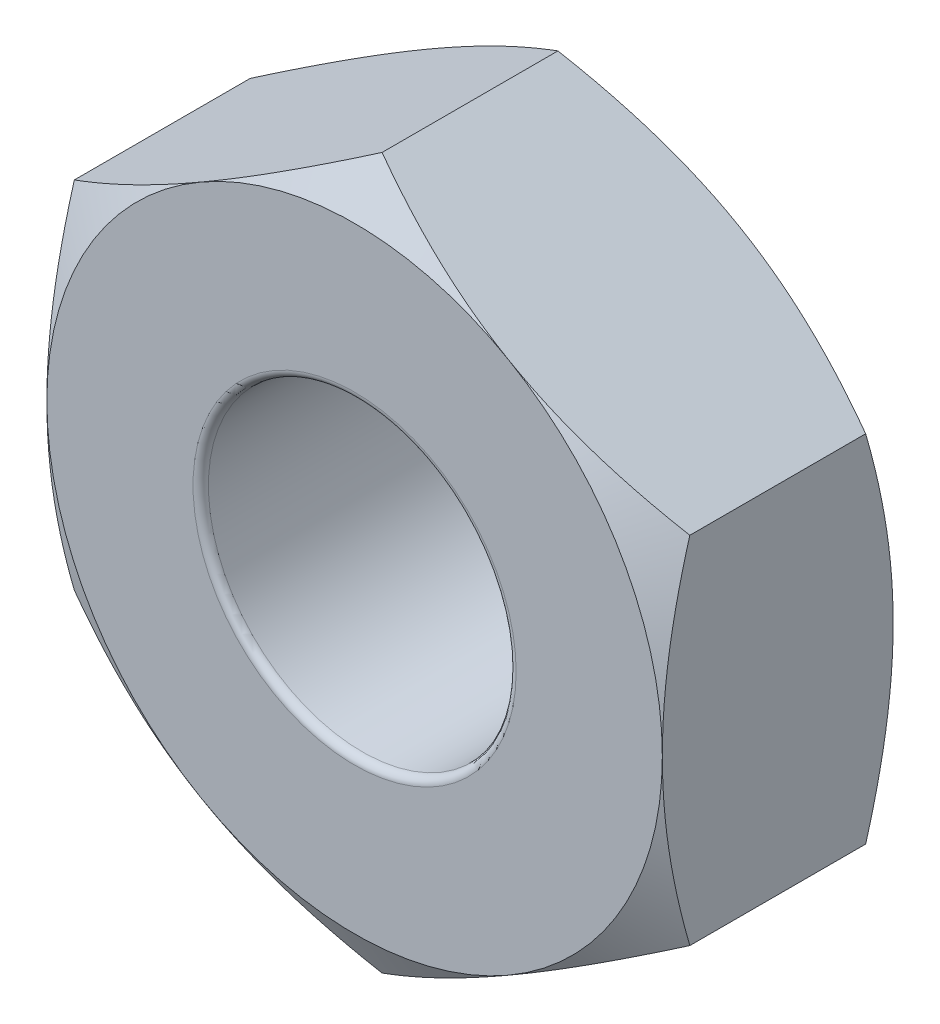
ISO-10303-21;
HEADER;
FILE_DESCRIPTION(('STEP AP214'),'2;1');
FILE_NAME('part.step','',(''),(''),'','','');
FILE_SCHEMA(('AUTOMOTIVE_DESIGN { 1 0 10303 214 1 1 1 1 }'));
ENDSEC;
DATA;
#1=APPLICATION_CONTEXT('core data for automotive mechanical design processes');
#2=APPLICATION_PROTOCOL_DEFINITION('international standard','automotive_design',2000,#1);
#3=PRODUCT_CONTEXT('',#1,'mechanical');
#4=PRODUCT('Part','Part','',(#3));
#5=PRODUCT_RELATED_PRODUCT_CATEGORY('part','',(#4));
#6=PRODUCT_DEFINITION_FORMATION('','',#4);
#7=PRODUCT_DEFINITION_CONTEXT('part definition',#1,'design');
#8=PRODUCT_DEFINITION('design','',#6,#7);
#9=PRODUCT_DEFINITION_SHAPE('','',#8);
#10=(LENGTH_UNIT() NAMED_UNIT(*) SI_UNIT(.MILLI.,.METRE.));
#11=(NAMED_UNIT(*) PLANE_ANGLE_UNIT() SI_UNIT($,.RADIAN.));
#12=(NAMED_UNIT(*) SI_UNIT($,.STERADIAN.) SOLID_ANGLE_UNIT());
#13=UNCERTAINTY_MEASURE_WITH_UNIT(LENGTH_MEASURE(1.E-05),#10,'distance_accuracy_value','');
#14=(GEOMETRIC_REPRESENTATION_CONTEXT(3) GLOBAL_UNCERTAINTY_ASSIGNED_CONTEXT((#13)) GLOBAL_UNIT_ASSIGNED_CONTEXT((#10,
#11,#12)) REPRESENTATION_CONTEXT('',''));
#15=CARTESIAN_POINT('',(0.,0.,0.));
#16=DIRECTION('',(0.,0.,1.));
#17=DIRECTION('',(1.,0.,0.));
#18=AXIS2_PLACEMENT_3D('',#15,#16,#17);
#19=CARTESIAN_POINT('',(-2.,-1.15470053837925,1.5));
#20=DIRECTION('',(0.5,0.866025403784439,0.));
#21=DIRECTION('',(-0.866025403784439,0.5,0.));
#22=AXIS2_PLACEMENT_3D('',#19,#20,#21);
#23=PLANE('',#22);
#24=CARTESIAN_POINT('',(0.00020000000000046,-2.30951654681234,0.178699466620498));
#25=CARTESIAN_POINT('',(-0.0876912629000593,-2.25877250251758,0.149389536100679));
#26=CARTESIAN_POINT('',(-0.176341194473591,-2.20759044065996,0.122732851980467));
#27=CARTESIAN_POINT('',(-0.355176246997802,-2.10433997494456,0.076202491020721));
#28=CARTESIAN_POINT('',(-0.445364546505036,-2.05226973594631,0.0563452763827793));
#29=CARTESIAN_POINT('',(-0.624623385763305,-1.94877459684592,0.0254334640232527));
#30=CARTESIAN_POINT('',(-0.713666338226303,-1.89736562427197,0.0141731515985311));
#31=CARTESIAN_POINT('',(-0.892171397785042,-1.79430568008402,0.000728662594641834));
#32=CARTESIAN_POINT('',(-0.981632855703957,-1.74265508327244,-0.00146664504653172));
#33=CARTESIAN_POINT('',(-1.1488083535488,-1.64613626458981,0.00309098933064883));
#34=CARTESIAN_POINT('',(-1.22654737026578,-1.60125362236173,0.00872487468701447));
#35=CARTESIAN_POINT('',(-1.38151891453613,-1.51178075956051,0.0265838952608282));
#36=CARTESIAN_POINT('',(-1.4587509057412,-1.46719084864821,0.0388151360234393));
#37=CARTESIAN_POINT('',(-1.6140421864822,-1.37753338590959,0.0693934368676098));
#38=CARTESIAN_POINT('',(-1.69208181310738,-1.33247718647009,0.0878701670657157));
#39=CARTESIAN_POINT('',(-1.84699686569213,-1.24303693915875,0.129805518212855));
#40=CARTESIAN_POINT('',(-1.92387427762312,-1.1986517446858,0.153254280492313));
#41=CARTESIAN_POINT('',(-2.0002,-1.15458506832541,0.178699466620497));
#42=B_SPLINE_CURVE_WITH_KNOTS('',3,(#24,#25,#26,#27,#28,#29,#30,#31,#32,#33,#34,#35,#36,#37,#38,
#39,#40,#41),.UNSPECIFIED.,.F.,.F.,(4,2,2,2,2,2,2,2,4),(0.,0.31703182469561,0.634825876346563,
0.944753967652636,1.25430138000371,1.52387047293094,1.79368946861028,2.06949491027634,
2.34475850821472),.UNSPECIFIED.);
#43=CARTESIAN_POINT('',(0.,-2.3094010767585,0.178632794954081));
#44=VERTEX_POINT('',#43);
#45=CARTESIAN_POINT('',(-1.,-1.73205080756888,0.));
#46=VERTEX_POINT('',#45);
#47=EDGE_CURVE('E374',#44,#46,#42,.T.);
#48=ORIENTED_EDGE('',*,*,#47,.F.);
#49=DIRECTION('',(0.,0.,-1.));
#50=VECTOR('',#49,1.);
#51=CARTESIAN_POINT('',(0.,-2.3094010767585,1.5));
#52=LINE('',#51,#50);
#53=CARTESIAN_POINT('',(0.,-2.3094010767585,1.32136720504592));
#54=VERTEX_POINT('',#53);
#55=EDGE_CURVE('E318',#54,#44,#52,.T.);
#56=ORIENTED_EDGE('',*,*,#55,.F.);
#57=CARTESIAN_POINT('',(-2.0002,-1.15458506832541,1.3213005333795));
#58=CARTESIAN_POINT('',(-1.91230873709994,-1.20532911262018,1.35061046389932));
#59=CARTESIAN_POINT('',(-1.82365880552641,-1.2565111744778,1.37726714801953));
#60=CARTESIAN_POINT('',(-1.6448237530022,-1.35976164019319,1.42379750897928));
#61=CARTESIAN_POINT('',(-1.55463545349496,-1.41183187919145,1.44365472361722));
#62=CARTESIAN_POINT('',(-1.37537661423669,-1.51532701829183,1.47456653597675));
#63=CARTESIAN_POINT('',(-1.2863336617737,-1.56673599086578,1.48582684840147));
#64=CARTESIAN_POINT('',(-1.10782860221496,-1.66979593505373,1.49927133740536));
#65=CARTESIAN_POINT('',(-1.01836714429604,-1.72144653186531,1.50146664504653));
#66=CARTESIAN_POINT('',(-0.851191646451202,-1.81796535054794,1.49690901066935));
#67=CARTESIAN_POINT('',(-0.773452629734216,-1.86284799277603,1.49127512531299));
#68=CARTESIAN_POINT('',(-0.618481085463866,-1.95232085557725,1.47341610473917));
#69=CARTESIAN_POINT('',(-0.541249094258801,-1.99691076648954,1.46118486397656));
#70=CARTESIAN_POINT('',(-0.385957813517799,-2.08656822922816,1.43060656313239));
#71=CARTESIAN_POINT('',(-0.30791818689262,-2.13162442866767,1.41212983293428));
#72=CARTESIAN_POINT('',(-0.153003134307865,-2.221064675979,1.37019448178714));
#73=CARTESIAN_POINT('',(-0.0761257223768793,-2.26544987045196,1.34674571950769));
#74=CARTESIAN_POINT('',(0.000200000000000715,-2.30951654681234,1.3213005333795));
#75=B_SPLINE_CURVE_WITH_KNOTS('',3,(#57,#58,#59,#60,#61,#62,#63,#64,#65,#66,#67,#68,#69,#70,#71,
#72,#73,#74),.UNSPECIFIED.,.F.,.F.,(4,2,2,2,2,2,2,2,4),(0.,0.31703182469561,0.634825876346563,
0.944753967652635,1.25430138000371,1.52387047293094,1.79368946861028,2.06949491027634,
2.34475850821472),.UNSPECIFIED.);
#76=CARTESIAN_POINT('',(-1.,-1.73205080756888,1.5));
#77=VERTEX_POINT('',#76);
#78=EDGE_CURVE('E257',#77,#54,#75,.T.);
#79=ORIENTED_EDGE('',*,*,#78,.F.);
#80=CARTESIAN_POINT('',(-2.,-1.15470053837926,1.32136720504593));
#81=VERTEX_POINT('',#80);
#82=EDGE_CURVE('E331',#81,#77,#75,.T.);
#83=ORIENTED_EDGE('',*,*,#82,.F.);
#84=DIRECTION('',(0.,0.,-1.));
#85=VECTOR('',#84,1.);
#86=CARTESIAN_POINT('',(-2.,-1.15470053837925,1.5));
#87=LINE('',#86,#85);
#88=CARTESIAN_POINT('',(-2.,-1.15470053837925,0.17863279495408));
#89=VERTEX_POINT('',#88);
#90=EDGE_CURVE('E329',#81,#89,#87,.T.);
#91=ORIENTED_EDGE('',*,*,#90,.T.);
#92=EDGE_CURVE('E211',#46,#89,#42,.T.);
#93=ORIENTED_EDGE('',*,*,#92,.F.);
#94=EDGE_LOOP('',(#48,#56,#79,#83,#91,#93));
#95=FACE_BOUND('',#94,.T.);
#96=ADVANCED_FACE('F37',(#95),#23,.F.);
#97=CARTESIAN_POINT('',(0.,-2.3094010767585,1.5));
#98=DIRECTION('',(-0.5,0.866025403784439,0.));
#99=DIRECTION('',(-0.866025403784439,-0.5,0.));
#100=AXIS2_PLACEMENT_3D('',#97,#98,#99);
#101=PLANE('',#100);
#102=CARTESIAN_POINT('',(2.0002,-1.15458506832541,0.178699466620498));
#103=CARTESIAN_POINT('',(1.91230873709994,-1.20532911262018,0.149389536100679));
#104=CARTESIAN_POINT('',(1.82365880552641,-1.2565111744778,0.122732851980467));
#105=CARTESIAN_POINT('',(1.6448237530022,-1.35976164019319,0.0762024910207215));
#106=CARTESIAN_POINT('',(1.55463545349496,-1.41183187919145,0.0563452763827797));
#107=CARTESIAN_POINT('',(1.37537661423669,-1.51532701829183,0.025433464023253));
#108=CARTESIAN_POINT('',(1.2863336617737,-1.56673599086578,0.0141731515985315));
#109=CARTESIAN_POINT('',(1.10782860221496,-1.66979593505373,0.000728662594642251));
#110=CARTESIAN_POINT('',(1.01836714429604,-1.72144653186531,-0.00146664504653122));
#111=CARTESIAN_POINT('',(0.851191646451202,-1.81796535054794,0.00309098933064939));
#112=CARTESIAN_POINT('',(0.773452629734217,-1.86284799277603,0.00872487468701502));
#113=CARTESIAN_POINT('',(0.618481085463867,-1.95232085557725,0.0265838952608286));
#114=CARTESIAN_POINT('',(0.541249094258802,-1.99691076648954,0.0388151360234396));
#115=CARTESIAN_POINT('',(0.3859578135178,-2.08656822922816,0.06939343686761));
#116=CARTESIAN_POINT('',(0.307918186892621,-2.13162442866767,0.0878701670657161));
#117=CARTESIAN_POINT('',(0.153003134307866,-2.221064675979,0.129805518212856));
#118=CARTESIAN_POINT('',(0.0761257223768806,-2.26544987045196,0.153254280492314));
#119=CARTESIAN_POINT('',(-0.000199999999999511,-2.30951654681234,0.178699466620498));
#120=B_SPLINE_CURVE_WITH_KNOTS('',3,(#102,#103,#104,#105,#106,#107,#108,#109,#110,#111,#112,
#113,#114,#115,#116,#117,#118,#119),.UNSPECIFIED.,.F.,.F.,(4,2,2,2,2,2,2,2,4),(0.,
0.31703182469561,0.634825876346563,0.944753967652636,1.25430138000371,1.52387047293094,
1.79368946861028,2.06949491027634,2.34475850821472),.UNSPECIFIED.);
#121=CARTESIAN_POINT('',(2.,-1.15470053837925,0.178632794954081));
#122=VERTEX_POINT('',#121);
#123=CARTESIAN_POINT('',(1.,-1.73205080756888,0.));
#124=VERTEX_POINT('',#123);
#125=EDGE_CURVE('E147',#122,#124,#120,.T.);
#126=ORIENTED_EDGE('',*,*,#125,.F.);
#127=DIRECTION('',(0.,0.,-1.));
#128=VECTOR('',#127,1.);
#129=CARTESIAN_POINT('',(2.,-1.15470053837925,1.5));
#130=LINE('',#129,#128);
#131=CARTESIAN_POINT('',(2.,-1.15470053837925,1.32136720504592));
#132=VERTEX_POINT('',#131);
#133=EDGE_CURVE('E162',#132,#122,#130,.T.);
#134=ORIENTED_EDGE('',*,*,#133,.F.);
#135=CARTESIAN_POINT('',(-0.000199999999999622,-2.30951654681234,1.3213005333795));
#136=CARTESIAN_POINT('',(0.0876912629000603,-2.25877250251758,1.35061046389932));
#137=CARTESIAN_POINT('',(0.176341194473592,-2.20759044065996,1.37726714801953));
#138=CARTESIAN_POINT('',(0.355176246997802,-2.10433997494456,1.42379750897928));
#139=CARTESIAN_POINT('',(0.445364546505037,-2.05226973594631,1.44365472361722));
#140=CARTESIAN_POINT('',(0.624623385763306,-1.94877459684592,1.47456653597675));
#141=CARTESIAN_POINT('',(0.713666338226304,-1.89736562427197,1.48582684840147));
#142=CARTESIAN_POINT('',(0.892171397785043,-1.79430568008402,1.49927133740536));
#143=CARTESIAN_POINT('',(0.981632855703958,-1.74265508327244,1.50146664504653));
#144=CARTESIAN_POINT('',(1.1488083535488,-1.64613626458981,1.49690901066935));
#145=CARTESIAN_POINT('',(1.22654737026578,-1.60125362236173,1.49127512531299));
#146=CARTESIAN_POINT('',(1.38151891453613,-1.51178075956051,1.47341610473917));
#147=CARTESIAN_POINT('',(1.4587509057412,-1.46719084864821,1.46118486397656));
#148=CARTESIAN_POINT('',(1.6140421864822,-1.37753338590959,1.43060656313239));
#149=CARTESIAN_POINT('',(1.69208181310738,-1.33247718647009,1.41212983293428));
#150=CARTESIAN_POINT('',(1.84699686569214,-1.24303693915875,1.37019448178714));
#151=CARTESIAN_POINT('',(1.92387427762312,-1.1986517446858,1.34674571950769));
#152=CARTESIAN_POINT('',(2.0002,-1.15458506832541,1.3213005333795));
#153=B_SPLINE_CURVE_WITH_KNOTS('',3,(#135,#136,#137,#138,#139,#140,#141,#142,#143,#144,#145,
#146,#147,#148,#149,#150,#151,#152),.UNSPECIFIED.,.F.,.F.,(4,2,2,2,2,2,2,2,4),(0.,
0.31703182469561,0.634825876346563,0.944753967652636,1.25430138000371,1.52387047293094,
1.79368946861028,2.06949491027634,2.34475850821472),.UNSPECIFIED.);
#154=CARTESIAN_POINT('',(1.,-1.73205080756888,1.5));
#155=VERTEX_POINT('',#154);
#156=EDGE_CURVE('E250',#155,#132,#153,.T.);
#157=ORIENTED_EDGE('',*,*,#156,.F.);
#158=EDGE_CURVE('E256',#54,#155,#153,.T.);
#159=ORIENTED_EDGE('',*,*,#158,.F.);
#160=ORIENTED_EDGE('',*,*,#55,.T.);
#161=EDGE_CURVE('E172',#124,#44,#120,.T.);
#162=ORIENTED_EDGE('',*,*,#161,.F.);
#163=EDGE_LOOP('',(#126,#134,#157,#159,#160,#162));
#164=FACE_BOUND('',#163,.T.);
#165=ADVANCED_FACE('F263',(#164),#101,.F.);
#166=CARTESIAN_POINT('',(2.,-1.15470053837925,1.5));
#167=DIRECTION('',(-1.,0.,0.));
#168=DIRECTION('',(0.,-1.,0.));
#169=AXIS2_PLACEMENT_3D('',#166,#167,#168);
#170=PLANE('',#169);
#171=CARTESIAN_POINT('',(2.,3.9086858120223,1.38024356206322));
#172=CARTESIAN_POINT('',(2.,3.81751112169324,1.33338477520942));
#173=CARTESIAN_POINT('',(2.,3.72620145046507,1.28679021631781));
#174=CARTESIAN_POINT('',(2.,3.54325228824929,1.19424910626193));
#175=CARTESIAN_POINT('',(2.,3.45161279093522,1.14830256761152));
#176=CARTESIAN_POINT('',(2.,3.17581300243889,1.01146715761723));
#177=CARTESIAN_POINT('',(2.,2.9910709203634,0.921737415753043));
#178=CARTESIAN_POINT('',(2.,2.70743624323685,0.788409395654004));
#179=CARTESIAN_POINT('',(2.,2.60934831774002,0.743100656319978));
#180=CARTESIAN_POINT('',(2.,2.41241507533712,0.654163775473776));
#181=CARTESIAN_POINT('',(2.,2.31356978752232,0.610535569794256));
#182=CARTESIAN_POINT('',(2.,2.11501734395706,0.525465312630819));
#183=CARTESIAN_POINT('',(2.,2.0153108187193,0.484021797433511));
#184=CARTESIAN_POINT('',(2.,1.81474539793162,0.403937006613858));
#185=CARTESIAN_POINT('',(2.,1.71388623674348,0.365296392668009));
#186=CARTESIAN_POINT('',(2.,1.49400593807688,0.285617620657406));
#187=CARTESIAN_POINT('',(2.,1.37474151517002,0.245241020544741));
#188=CARTESIAN_POINT('',(2.,1.13410850020832,0.171425178991217));
#189=CARTESIAN_POINT('',(2.,1.0127410198025,0.137982386760639));
#190=CARTESIAN_POINT('',(2.,0.770071934944817,0.0810163135177482));
#191=CARTESIAN_POINT('',(2.,0.648812992268316,0.0573164449831602));
#192=CARTESIAN_POINT('',(2.,0.404608758962328,0.0214266196550799));
#193=CARTESIAN_POINT('',(2.,0.281664490388411,0.00922997508793508));
#194=CARTESIAN_POINT('',(2.,0.033541974826982,-0.0020708547732142));
#195=CARTESIAN_POINT('',(2.,-0.0916445286709639,-0.00100267071105159));
#196=CARTESIAN_POINT('',(2.,-0.341193409529,0.014484045237909));
#197=CARTESIAN_POINT('',(2.,-0.465555475947226,0.0289073543713882));
#198=CARTESIAN_POINT('',(2.,-0.714833183390076,0.0695474304125028));
#199=CARTESIAN_POINT('',(2.,-0.83970964218488,0.0959955839540993));
#200=CARTESIAN_POINT('',(2.,-1.08715459095749,0.157986894429598));
#201=CARTESIAN_POINT('',(2.,-1.20972240762972,0.193532661864587));
#202=CARTESIAN_POINT('',(2.,-1.44650470413582,0.269280519283634));
#203=CARTESIAN_POINT('',(2.,-1.56082665519536,0.309153182000627));
#204=CARTESIAN_POINT('',(2.,-1.78785420479763,0.393292544621002));
#205=CARTESIAN_POINT('',(2.,-1.90055942493322,0.437560254612615));
#206=CARTESIAN_POINT('',(2.,-2.12474648121528,0.529372373860236));
#207=CARTESIAN_POINT('',(2.,-2.23622699843601,0.576919977737398));
#208=CARTESIAN_POINT('',(2.,-2.45812606854002,0.67443498494533));
#209=CARTESIAN_POINT('',(2.,-2.56854456483181,0.724402516378928));
#210=CARTESIAN_POINT('',(2.,-2.78238975570627,0.823331957292793));
#211=CARTESIAN_POINT('',(2.,-2.88586269009034,0.87219431445944));
#212=CARTESIAN_POINT('',(2.,-3.09219555395058,0.971202074310625));
#213=CARTESIAN_POINT('',(2.,-3.19505546409504,1.02134751719606));
#214=CARTESIAN_POINT('',(2.,-3.39994809054478,1.12249261908677));
#215=CARTESIAN_POINT('',(2.,-3.50198239517474,1.1734890679984));
#216=CARTESIAN_POINT('',(2.,-3.70562803087648,1.27629914354312));
#217=CARTESIAN_POINT('',(2.,-3.80723939675145,1.32811270118693));
#218=CARTESIAN_POINT('',(2.,-3.9086858120223,1.38024356206323));
#219=B_SPLINE_CURVE_WITH_KNOTS('',3,(#171,#172,#173,#174,#175,#176,#177,#178,#179,#180,#181,
#182,#183,#184,#185,#186,#187,#188,#189,#190,#191,#192,#193,#194,#195,#196,#197,#198,#199,#200,
#201,#202,#203,#204,#205,#206,#207,#208,#209,#210,#211,#212,#213,#214,#215,#216,#217,#218),
.UNSPECIFIED.,.F.,.F.,(4,2,2,2,2,2,2,2,2,2,2,2,2,2,2,2,2,2,2,2,2,2,2,4),(0.,0.307531563856155,
0.615069058317577,1.23115557383005,1.55528461857819,1.8794012749051,2.20329794302309,
2.52727082574405,2.9048604545366,3.28225624019068,3.65247322929853,4.02247484779028,
4.39728941630346,4.77223811112902,5.15472880172826,5.53732936883045,5.90044039858862,
6.26363507408059,6.62718863760779,6.99076146751934,7.33404016464889,7.67732963038956,
8.01953135999517,8.36170435024385),.UNSPECIFIED.);
#220=CARTESIAN_POINT('',(2.,1.15470053837925,0.178632794954081));
#221=VERTEX_POINT('',#220);
#222=CARTESIAN_POINT('',(2.,0.,0.));
#223=VERTEX_POINT('',#222);
#224=EDGE_CURVE('E126',#221,#223,#219,.T.);
#225=ORIENTED_EDGE('',*,*,#224,.F.);
#226=DIRECTION('',(0.,0.,-1.));
#227=VECTOR('',#226,1.);
#228=CARTESIAN_POINT('',(2.,1.15470053837925,1.5));
#229=LINE('',#228,#227);
#230=CARTESIAN_POINT('',(2.,1.15470053837925,1.32136720504592));
#231=VERTEX_POINT('',#230);
#232=EDGE_CURVE('E322',#231,#221,#229,.T.);
#233=ORIENTED_EDGE('',*,*,#232,.F.);
#234=CARTESIAN_POINT('',(2.,-3.9086858120223,0.119756437936775));
#235=CARTESIAN_POINT('',(2.,-3.81751112169324,0.166615224790584));
#236=CARTESIAN_POINT('',(2.,-3.72620145046507,0.213209783682193));
#237=CARTESIAN_POINT('',(2.,-3.54325228824929,0.305750893738074));
#238=CARTESIAN_POINT('',(2.,-3.45161279093522,0.351697432388484));
#239=CARTESIAN_POINT('',(2.,-3.17581300243889,0.488532842382774));
#240=CARTESIAN_POINT('',(2.,-2.9910709203634,0.578262584246956));
#241=CARTESIAN_POINT('',(2.,-2.70743624323685,0.711590604345996));
#242=CARTESIAN_POINT('',(2.,-2.60934831774002,0.756899343680022));
#243=CARTESIAN_POINT('',(2.,-2.41241507533712,0.845836224526223));
#244=CARTESIAN_POINT('',(2.,-2.31356978752231,0.889464430205743));
#245=CARTESIAN_POINT('',(2.,-2.11501734395706,0.974534687369181));
#246=CARTESIAN_POINT('',(2.,-2.0153108187193,1.01597820256649));
#247=CARTESIAN_POINT('',(2.,-1.81474539793162,1.09606299338614));
#248=CARTESIAN_POINT('',(2.,-1.71388623674348,1.13470360733199));
#249=CARTESIAN_POINT('',(2.,-1.49400593807688,1.21438237934259));
#250=CARTESIAN_POINT('',(2.,-1.37474151517002,1.25475897945526));
#251=CARTESIAN_POINT('',(2.,-1.13410850020832,1.32857482100878));
#252=CARTESIAN_POINT('',(2.,-1.0127410198025,1.36201761323936));
#253=CARTESIAN_POINT('',(2.,-0.770071934944816,1.41898368648225));
#254=CARTESIAN_POINT('',(2.,-0.648812992268315,1.44268355501684));
#255=CARTESIAN_POINT('',(2.,-0.404608758962328,1.47857338034492));
#256=CARTESIAN_POINT('',(2.,-0.281664490388411,1.49077002491207));
#257=CARTESIAN_POINT('',(2.,-0.0335419748269814,1.50207085477321));
#258=CARTESIAN_POINT('',(2.,0.0916445286709641,1.50100267071105));
#259=CARTESIAN_POINT('',(2.,0.341193409529,1.48551595476209));
#260=CARTESIAN_POINT('',(2.,0.465555475947226,1.47109264562861));
#261=CARTESIAN_POINT('',(2.,0.714833183390077,1.4304525695875));
#262=CARTESIAN_POINT('',(2.,0.83970964218488,1.4040044160459));
#263=CARTESIAN_POINT('',(2.,1.08715459095749,1.3420131055704));
#264=CARTESIAN_POINT('',(2.,1.20972240762972,1.30646733813541));
#265=CARTESIAN_POINT('',(2.,1.44650470413582,1.23071948071637));
#266=CARTESIAN_POINT('',(2.,1.56082665519536,1.19084681799937));
#267=CARTESIAN_POINT('',(2.,1.78785420479763,1.106707455379));
#268=CARTESIAN_POINT('',(2.,1.90055942493322,1.06243974538738));
#269=CARTESIAN_POINT('',(2.,2.12474648121528,0.970627626139764));
#270=CARTESIAN_POINT('',(2.,2.23622699843601,0.923080022262601));
#271=CARTESIAN_POINT('',(2.,2.45812606854002,0.82556501505467));
#272=CARTESIAN_POINT('',(2.,2.56854456483182,0.775597483621073));
#273=CARTESIAN_POINT('',(2.,2.78238975570627,0.676668042707208));
#274=CARTESIAN_POINT('',(2.,2.88586269009034,0.627805685540561));
#275=CARTESIAN_POINT('',(2.,3.09219555395058,0.528797925689375));
#276=CARTESIAN_POINT('',(2.,3.19505546409504,0.478652482803938));
#277=CARTESIAN_POINT('',(2.,3.39994809054478,0.377507380913227));
#278=CARTESIAN_POINT('',(2.,3.50198239517474,0.326510932001602));
#279=CARTESIAN_POINT('',(2.,3.70562803087648,0.223700856456886));
#280=CARTESIAN_POINT('',(2.,3.80723939675145,0.17188729881307));
#281=CARTESIAN_POINT('',(2.,3.9086858120223,0.119756437936777));
#282=B_SPLINE_CURVE_WITH_KNOTS('',3,(#234,#235,#236,#237,#238,#239,#240,#241,#242,#243,#244,
#245,#246,#247,#248,#249,#250,#251,#252,#253,#254,#255,#256,#257,#258,#259,#260,#261,#262,#263,
#264,#265,#266,#267,#268,#269,#270,#271,#272,#273,#274,#275,#276,#277,#278,#279,#280,#281),
.UNSPECIFIED.,.F.,.F.,(4,2,2,2,2,2,2,2,2,2,2,2,2,2,2,2,2,2,2,2,2,2,2,4),(0.,0.307531563856155,
0.615069058317578,1.23115557383005,1.55528461857819,1.8794012749051,2.20329794302309,
2.52727082574405,2.9048604545366,3.28225624019068,3.65247322929853,4.02247484779028,
4.39728941630346,4.77223811112902,5.15472880172826,5.53732936883045,5.90044039858863,
6.26363507408059,6.62718863760779,6.99076146751934,7.33404016464889,7.67732963038956,
8.01953135999517,8.36170435024385),.UNSPECIFIED.);
#283=CARTESIAN_POINT('',(2.,0.,1.5));
#284=VERTEX_POINT('',#283);
#285=EDGE_CURVE('E243',#284,#231,#282,.T.);
#286=ORIENTED_EDGE('',*,*,#285,.F.);
#287=EDGE_CURVE('E249',#132,#284,#282,.T.);
#288=ORIENTED_EDGE('',*,*,#287,.F.);
#289=ORIENTED_EDGE('',*,*,#133,.T.);
#290=EDGE_CURVE('E139',#223,#122,#219,.T.);
#291=ORIENTED_EDGE('',*,*,#290,.F.);
#292=EDGE_LOOP('',(#225,#233,#286,#288,#289,#291));
#293=FACE_BOUND('',#292,.T.);
#294=ADVANCED_FACE('F159',(#293),#170,.F.);
#295=CARTESIAN_POINT('',(2.,1.15470053837925,1.5));
#296=DIRECTION('',(-0.5,-0.866025403784439,0.));
#297=DIRECTION('',(0.866025403784439,-0.5,0.));
#298=AXIS2_PLACEMENT_3D('',#295,#296,#297);
#299=PLANE('',#298);
#300=CARTESIAN_POINT('',(-0.000200000000000447,2.30951654681234,0.178699466620497));
#301=CARTESIAN_POINT('',(0.0876912629000596,2.25877250251757,0.149389536100678));
#302=CARTESIAN_POINT('',(0.176341194473591,2.20759044065995,0.122732851980466));
#303=CARTESIAN_POINT('',(0.355176246997801,2.10433997494456,0.0762024910207209));
#304=CARTESIAN_POINT('',(0.445364546505036,2.0522697359463,0.0563452763827791));
#305=CARTESIAN_POINT('',(0.624623385763305,1.94877459684592,0.0254334640232525));
#306=CARTESIAN_POINT('',(0.713666338226303,1.89736562427197,0.0141731515985311));
#307=CARTESIAN_POINT('',(0.892171397785042,1.79430568008402,0.00072866259464194));
#308=CARTESIAN_POINT('',(0.981632855703957,1.74265508327244,-0.00146664504653172));
#309=CARTESIAN_POINT('',(1.1488083535488,1.64613626458981,0.00309098933064883));
#310=CARTESIAN_POINT('',(1.22654737026578,1.60125362236173,0.00872487468701457));
#311=CARTESIAN_POINT('',(1.38151891453613,1.51178075956051,0.0265838952608283));
#312=CARTESIAN_POINT('',(1.4587509057412,1.46719084864821,0.0388151360234393));
#313=CARTESIAN_POINT('',(1.6140421864822,1.37753338590959,0.0693934368676097));
#314=CARTESIAN_POINT('',(1.69208181310738,1.33247718647009,0.0878701670657158));
#315=CARTESIAN_POINT('',(1.84699686569213,1.24303693915875,0.129805518212856));
#316=CARTESIAN_POINT('',(1.92387427762312,1.1986517446858,0.153254280492313));
#317=CARTESIAN_POINT('',(2.0002,1.15458506832541,0.178699466620497));
#318=B_SPLINE_CURVE_WITH_KNOTS('',3,(#300,#301,#302,#303,#304,#305,#306,#307,#308,#309,#310,
#311,#312,#313,#314,#315,#316,#317),.UNSPECIFIED.,.F.,.F.,(4,2,2,2,2,2,2,2,4),(0.,
0.31703182469561,0.634825876346563,0.944753967652635,1.25430138000371,1.52387047293094,
1.79368946861028,2.06949491027634,2.34475850821472),.UNSPECIFIED.);
#319=CARTESIAN_POINT('',(0.,2.3094010767585,0.17863279495408));
#320=VERTEX_POINT('',#319);
#321=CARTESIAN_POINT('',(0.999999999999999,1.73205080756888,0.));
#322=VERTEX_POINT('',#321);
#323=EDGE_CURVE('E52',#320,#322,#318,.T.);
#324=ORIENTED_EDGE('',*,*,#323,.F.);
#325=DIRECTION('',(0.,0.,-1.));
#326=VECTOR('',#325,1.);
#327=CARTESIAN_POINT('',(0.,2.3094010767585,1.5));
#328=LINE('',#327,#326);
#329=CARTESIAN_POINT('',(0.,2.3094010767585,1.32136720504592));
#330=VERTEX_POINT('',#329);
#331=EDGE_CURVE('E324',#330,#320,#328,.T.);
#332=ORIENTED_EDGE('',*,*,#331,.F.);
#333=CARTESIAN_POINT('',(2.0002,1.15458506832541,1.3213005333795));
#334=CARTESIAN_POINT('',(1.91230873709994,1.20532911262018,1.35061046389932));
#335=CARTESIAN_POINT('',(1.82365880552641,1.2565111744778,1.37726714801953));
#336=CARTESIAN_POINT('',(1.6448237530022,1.35976164019319,1.42379750897928));
#337=CARTESIAN_POINT('',(1.55463545349496,1.41183187919145,1.44365472361722));
#338=CARTESIAN_POINT('',(1.37537661423669,1.51532701829183,1.47456653597675));
#339=CARTESIAN_POINT('',(1.2863336617737,1.56673599086578,1.48582684840147));
#340=CARTESIAN_POINT('',(1.10782860221496,1.66979593505373,1.49927133740536));
#341=CARTESIAN_POINT('',(1.01836714429604,1.72144653186531,1.50146664504653));
#342=CARTESIAN_POINT('',(0.851191646451202,1.81796535054794,1.49690901066935));
#343=CARTESIAN_POINT('',(0.773452629734216,1.86284799277603,1.49127512531299));
#344=CARTESIAN_POINT('',(0.618481085463866,1.95232085557725,1.47341610473917));
#345=CARTESIAN_POINT('',(0.541249094258801,1.99691076648954,1.46118486397656));
#346=CARTESIAN_POINT('',(0.385957813517799,2.08656822922816,1.43060656313239));
#347=CARTESIAN_POINT('',(0.30791818689262,2.13162442866767,1.41212983293428));
#348=CARTESIAN_POINT('',(0.153003134307865,2.221064675979,1.37019448178714));
#349=CARTESIAN_POINT('',(0.0761257223768795,2.26544987045196,1.34674571950769));
#350=CARTESIAN_POINT('',(-0.000200000000000552,2.30951654681234,1.3213005333795));
#351=B_SPLINE_CURVE_WITH_KNOTS('',3,(#333,#334,#335,#336,#337,#338,#339,#340,#341,#342,#343,
#344,#345,#346,#347,#348,#349,#350),.UNSPECIFIED.,.F.,.F.,(4,2,2,2,2,2,2,2,4),(0.,
0.31703182469561,0.634825876346563,0.944753967652635,1.25430138000371,1.52387047293094,
1.79368946861028,2.06949491027634,2.34475850821472),.UNSPECIFIED.);
#352=CARTESIAN_POINT('',(0.999999999999999,1.73205080756888,1.5));
#353=VERTEX_POINT('',#352);
#354=EDGE_CURVE('E230',#353,#330,#351,.T.);
#355=ORIENTED_EDGE('',*,*,#354,.F.);
#356=EDGE_CURVE('E236',#231,#353,#351,.T.);
#357=ORIENTED_EDGE('',*,*,#356,.F.);
#358=ORIENTED_EDGE('',*,*,#232,.T.);
#359=EDGE_CURVE('E133',#322,#221,#318,.T.);
#360=ORIENTED_EDGE('',*,*,#359,.F.);
#361=EDGE_LOOP('',(#324,#332,#355,#357,#358,#360));
#362=FACE_BOUND('',#361,.T.);
#363=ADVANCED_FACE('F222',(#362),#299,.F.);
#364=CARTESIAN_POINT('',(0.,2.3094010767585,1.5));
#365=DIRECTION('',(0.5,-0.866025403784439,0.));
#366=DIRECTION('',(0.866025403784439,0.5,0.));
#367=AXIS2_PLACEMENT_3D('',#364,#365,#366);
#368=PLANE('',#367);
#369=CARTESIAN_POINT('',(-2.0002,1.15458506832541,0.178699466620497));
#370=CARTESIAN_POINT('',(-1.91230873709994,1.20532911262018,0.149389536100679));
#371=CARTESIAN_POINT('',(-1.82365880552641,1.2565111744778,0.122732851980467));
#372=CARTESIAN_POINT('',(-1.6448237530022,1.35976164019319,0.076202491020721));
#373=CARTESIAN_POINT('',(-1.55463545349496,1.41183187919145,0.0563452763827791));
#374=CARTESIAN_POINT('',(-1.37537661423669,1.51532701829183,0.0254334640232526));
#375=CARTESIAN_POINT('',(-1.2863336617737,1.56673599086578,0.0141731515985313));
#376=CARTESIAN_POINT('',(-1.10782860221496,1.66979593505373,0.000728662594642064));
#377=CARTESIAN_POINT('',(-1.01836714429604,1.72144653186531,-0.00146664504653166));
#378=CARTESIAN_POINT('',(-0.851191646451202,1.81796535054794,0.00309098933064878));
#379=CARTESIAN_POINT('',(-0.773452629734216,1.86284799277603,0.00872487468701445));
#380=CARTESIAN_POINT('',(-0.618481085463867,1.95232085557725,0.0265838952608282));
#381=CARTESIAN_POINT('',(-0.541249094258802,1.99691076648954,0.0388151360234393));
#382=CARTESIAN_POINT('',(-0.385957813517799,2.08656822922816,0.0693934368676098));
#383=CARTESIAN_POINT('',(-0.307918186892621,2.13162442866767,0.0878701670657157));
#384=CARTESIAN_POINT('',(-0.153003134307866,2.221064675979,0.129805518212855));
#385=CARTESIAN_POINT('',(-0.0761257223768805,2.26544987045196,0.153254280492313));
#386=CARTESIAN_POINT('',(0.000199999999999749,2.30951654681234,0.178699466620497));
#387=B_SPLINE_CURVE_WITH_KNOTS('',3,(#369,#370,#371,#372,#373,#374,#375,#376,#377,#378,#379,
#380,#381,#382,#383,#384,#385,#386),.UNSPECIFIED.,.F.,.F.,(4,2,2,2,2,2,2,2,4),(0.,
0.31703182469561,0.634825876346563,0.944753967652636,1.25430138000371,1.52387047293094,
1.79368946861028,2.06949491027634,2.34475850821472),.UNSPECIFIED.);
#388=CARTESIAN_POINT('',(-2.,1.15470053837926,0.178632794954074));
#389=VERTEX_POINT('',#388);
#390=CARTESIAN_POINT('',(-1.,1.73205080756888,0.));
#391=VERTEX_POINT('',#390);
#392=EDGE_CURVE('E60',#389,#391,#387,.T.);
#393=ORIENTED_EDGE('',*,*,#392,.F.);
#394=DIRECTION('',(0.,0.,-1.));
#395=VECTOR('',#394,1.);
#396=CARTESIAN_POINT('',(-2.,1.15470053837925,1.5));
#397=LINE('',#396,#395);
#398=CARTESIAN_POINT('',(-2.,1.15470053837925,1.32136720504592));
#399=VERTEX_POINT('',#398);
#400=EDGE_CURVE('E327',#399,#389,#397,.T.);
#401=ORIENTED_EDGE('',*,*,#400,.F.);
#402=CARTESIAN_POINT('',(0.000199999999999584,2.30951654681234,1.3213005333795));
#403=CARTESIAN_POINT('',(-0.0876912629000604,2.25877250251758,1.35061046389932));
#404=CARTESIAN_POINT('',(-0.176341194473592,2.20759044065995,1.37726714801953));
#405=CARTESIAN_POINT('',(-0.355176246997802,2.10433997494456,1.42379750897928));
#406=CARTESIAN_POINT('',(-0.445364546505037,2.0522697359463,1.44365472361722));
#407=CARTESIAN_POINT('',(-0.624623385763306,1.94877459684592,1.47456653597675));
#408=CARTESIAN_POINT('',(-0.713666338226304,1.89736562427197,1.48582684840147));
#409=CARTESIAN_POINT('',(-0.892171397785043,1.79430568008402,1.49927133740536));
#410=CARTESIAN_POINT('',(-0.981632855703958,1.74265508327244,1.50146664504653));
#411=CARTESIAN_POINT('',(-1.1488083535488,1.64613626458981,1.49690901066935));
#412=CARTESIAN_POINT('',(-1.22654737026578,1.60125362236173,1.49127512531299));
#413=CARTESIAN_POINT('',(-1.38151891453613,1.51178075956051,1.47341610473917));
#414=CARTESIAN_POINT('',(-1.4587509057412,1.46719084864821,1.46118486397656));
#415=CARTESIAN_POINT('',(-1.6140421864822,1.37753338590959,1.43060656313239));
#416=CARTESIAN_POINT('',(-1.69208181310738,1.33247718647009,1.41212983293428));
#417=CARTESIAN_POINT('',(-1.84699686569213,1.24303693915875,1.37019448178714));
#418=CARTESIAN_POINT('',(-1.92387427762312,1.1986517446858,1.34674571950769));
#419=CARTESIAN_POINT('',(-2.0002,1.15458506832541,1.3213005333795));
#420=B_SPLINE_CURVE_WITH_KNOTS('',3,(#402,#403,#404,#405,#406,#407,#408,#409,#410,#411,#412,
#413,#414,#415,#416,#417,#418,#419),.UNSPECIFIED.,.F.,.F.,(4,2,2,2,2,2,2,2,4),(0.,
0.31703182469561,0.634825876346563,0.944753967652635,1.25430138000371,1.52387047293094,
1.79368946861028,2.06949491027634,2.34475850821472),.UNSPECIFIED.);
#421=CARTESIAN_POINT('',(-1.,1.73205080756888,1.5));
#422=VERTEX_POINT('',#421);
#423=EDGE_CURVE('E238',#422,#399,#420,.T.);
#424=ORIENTED_EDGE('',*,*,#423,.F.);
#425=EDGE_CURVE('E237',#330,#422,#420,.T.);
#426=ORIENTED_EDGE('',*,*,#425,.F.);
#427=ORIENTED_EDGE('',*,*,#331,.T.);
#428=EDGE_CURVE('E221',#391,#320,#387,.T.);
#429=ORIENTED_EDGE('',*,*,#428,.F.);
#430=EDGE_LOOP('',(#393,#401,#424,#426,#427,#429));
#431=FACE_BOUND('',#430,.T.);
#432=ADVANCED_FACE('F225',(#431),#368,.F.);
#433=CARTESIAN_POINT('',(-2.,1.15470053837925,1.5));
#434=DIRECTION('',(1.,0.,0.));
#435=DIRECTION('',(0.,1.,0.));
#436=AXIS2_PLACEMENT_3D('',#433,#434,#435);
#437=PLANE('',#436);
#438=CARTESIAN_POINT('',(-2.,-3.9086858120223,1.38024356206322));
#439=CARTESIAN_POINT('',(-2.,-3.81751112169324,1.33338477520942));
#440=CARTESIAN_POINT('',(-2.,-3.72620145046507,1.28679021631781));
#441=CARTESIAN_POINT('',(-2.,-3.54325228824929,1.19424910626193));
#442=CARTESIAN_POINT('',(-2.,-3.45161279093522,1.14830256761152));
#443=CARTESIAN_POINT('',(-2.,-3.17581300243889,1.01146715761723));
#444=CARTESIAN_POINT('',(-2.,-2.9910709203634,0.921737415753043));
#445=CARTESIAN_POINT('',(-2.,-2.70743624323685,0.788409395654004));
#446=CARTESIAN_POINT('',(-2.,-2.60934831774002,0.743100656319977));
#447=CARTESIAN_POINT('',(-2.,-2.41241507533712,0.654163775473776));
#448=CARTESIAN_POINT('',(-2.,-2.31356978752232,0.610535569794256));
#449=CARTESIAN_POINT('',(-2.,-2.11501734395706,0.525465312630819));
#450=CARTESIAN_POINT('',(-2.,-2.0153108187193,0.48402179743351));
#451=CARTESIAN_POINT('',(-2.,-1.81474539793162,0.403937006613857));
#452=CARTESIAN_POINT('',(-2.,-1.71388623674347,0.365296392668008));
#453=CARTESIAN_POINT('',(-2.,-1.49400593807688,0.285617620657405));
#454=CARTESIAN_POINT('',(-2.,-1.37474151517002,0.245241020544741));
#455=CARTESIAN_POINT('',(-2.,-1.13410850020832,0.171425178991217));
#456=CARTESIAN_POINT('',(-2.,-1.0127410198025,0.137982386760638));
#457=CARTESIAN_POINT('',(-2.,-0.770071934944816,0.081016313517748));
#458=CARTESIAN_POINT('',(-2.,-0.648812992268315,0.0573164449831596));
#459=CARTESIAN_POINT('',(-2.,-0.404608758962327,0.0214266196550793));
#460=CARTESIAN_POINT('',(-2.,-0.28166449038841,0.00922997508793464));
#461=CARTESIAN_POINT('',(-2.,-0.033541974826981,-0.00207085477321446));
#462=CARTESIAN_POINT('',(-2.,0.0916445286709646,-0.00100267071105191));
#463=CARTESIAN_POINT('',(-2.,0.341193409529,0.0144840452379086));
#464=CARTESIAN_POINT('',(-2.,0.465555475947226,0.0289073543713877));
#465=CARTESIAN_POINT('',(-2.,0.714833183390077,0.0695474304125024));
#466=CARTESIAN_POINT('',(-2.,0.839709642184881,0.095995583954099));
#467=CARTESIAN_POINT('',(-2.,1.08715459095749,0.157986894429597));
#468=CARTESIAN_POINT('',(-2.,1.20972240762972,0.193532661864587));
#469=CARTESIAN_POINT('',(-2.,1.44650470413582,0.269280519283634));
#470=CARTESIAN_POINT('',(-2.,1.56082665519536,0.309153182000627));
#471=CARTESIAN_POINT('',(-2.,1.78785420479763,0.393292544621002));
#472=CARTESIAN_POINT('',(-2.,1.90055942493322,0.437560254612616));
#473=CARTESIAN_POINT('',(-2.,2.12474648121528,0.529372373860237));
#474=CARTESIAN_POINT('',(-2.,2.23622699843601,0.576919977737399));
#475=CARTESIAN_POINT('',(-2.,2.45812606854002,0.674434984945331));
#476=CARTESIAN_POINT('',(-2.,2.56854456483182,0.724402516378928));
#477=CARTESIAN_POINT('',(-2.,2.78238975570627,0.823331957292793));
#478=CARTESIAN_POINT('',(-2.,2.88586269009034,0.87219431445944));
#479=CARTESIAN_POINT('',(-2.,3.09219555395058,0.971202074310625));
#480=CARTESIAN_POINT('',(-2.,3.19505546409504,1.02134751719606));
#481=CARTESIAN_POINT('',(-2.,3.39994809054478,1.12249261908677));
#482=CARTESIAN_POINT('',(-2.,3.50198239517474,1.1734890679984));
#483=CARTESIAN_POINT('',(-2.,3.70562803087648,1.27629914354311));
#484=CARTESIAN_POINT('',(-2.,3.80723939675145,1.32811270118693));
#485=CARTESIAN_POINT('',(-2.,3.9086858120223,1.38024356206322));
#486=B_SPLINE_CURVE_WITH_KNOTS('',3,(#438,#439,#440,#441,#442,#443,#444,#445,#446,#447,#448,
#449,#450,#451,#452,#453,#454,#455,#456,#457,#458,#459,#460,#461,#462,#463,#464,#465,#466,#467,
#468,#469,#470,#471,#472,#473,#474,#475,#476,#477,#478,#479,#480,#481,#482,#483,#484,#485),
.UNSPECIFIED.,.F.,.F.,(4,2,2,2,2,2,2,2,2,2,2,2,2,2,2,2,2,2,2,2,2,2,2,4),(0.,0.307531563856155,
0.615069058317578,1.23115557383005,1.55528461857819,1.8794012749051,2.20329794302309,
2.52727082574405,2.9048604545366,3.28225624019068,3.65247322929854,4.02247484779028,
4.39728941630346,4.77223811112902,5.15472880172826,5.53732936883045,5.90044039858863,
6.26363507408059,6.62718863760779,6.99076146751934,7.33404016464889,7.67732963038956,
8.01953135999517,8.36170435024385),.UNSPECIFIED.);
#487=CARTESIAN_POINT('',(-2.,0.,0.));
#488=VERTEX_POINT('',#487);
#489=EDGE_CURVE('E382',#89,#488,#486,.T.);
#490=ORIENTED_EDGE('',*,*,#489,.F.);
#491=ORIENTED_EDGE('',*,*,#90,.F.);
#492=CARTESIAN_POINT('',(-2.,3.9086858120223,0.119756437936776));
#493=CARTESIAN_POINT('',(-2.,3.81751112169324,0.166615224790585));
#494=CARTESIAN_POINT('',(-2.,3.72620145046507,0.213209783682194));
#495=CARTESIAN_POINT('',(-2.,3.54325228824929,0.305750893738074));
#496=CARTESIAN_POINT('',(-2.,3.45161279093522,0.351697432388485));
#497=CARTESIAN_POINT('',(-2.,3.17581300243889,0.488532842382775));
#498=CARTESIAN_POINT('',(-2.,2.9910709203634,0.578262584246957));
#499=CARTESIAN_POINT('',(-2.,2.70743624323685,0.711590604345996));
#500=CARTESIAN_POINT('',(-2.,2.60934831774002,0.756899343680022));
#501=CARTESIAN_POINT('',(-2.,2.41241507533712,0.845836224526224));
#502=CARTESIAN_POINT('',(-2.,2.31356978752232,0.889464430205744));
#503=CARTESIAN_POINT('',(-2.,2.11501734395706,0.974534687369181));
#504=CARTESIAN_POINT('',(-2.,2.0153108187193,1.01597820256649));
#505=CARTESIAN_POINT('',(-2.,1.81474539793162,1.09606299338614));
#506=CARTESIAN_POINT('',(-2.,1.71388623674347,1.13470360733199));
#507=CARTESIAN_POINT('',(-2.,1.49400593807688,1.21438237934259));
#508=CARTESIAN_POINT('',(-2.,1.37474151517002,1.25475897945526));
#509=CARTESIAN_POINT('',(-2.,1.13410850020832,1.32857482100878));
#510=CARTESIAN_POINT('',(-2.,1.0127410198025,1.36201761323936));
#511=CARTESIAN_POINT('',(-2.,0.770071934944816,1.41898368648225));
#512=CARTESIAN_POINT('',(-2.,0.648812992268315,1.44268355501684));
#513=CARTESIAN_POINT('',(-2.,0.404608758962328,1.47857338034492));
#514=CARTESIAN_POINT('',(-2.,0.28166449038841,1.49077002491207));
#515=CARTESIAN_POINT('',(-2.,0.0335419748269809,1.50207085477321));
#516=CARTESIAN_POINT('',(-2.,-0.0916445286709649,1.50100267071105));
#517=CARTESIAN_POINT('',(-2.,-0.341193409529001,1.48551595476209));
#518=CARTESIAN_POINT('',(-2.,-0.465555475947227,1.47109264562861));
#519=CARTESIAN_POINT('',(-2.,-0.714833183390077,1.4304525695875));
#520=CARTESIAN_POINT('',(-2.,-0.839709642184881,1.4040044160459));
#521=CARTESIAN_POINT('',(-2.,-1.08715459095749,1.3420131055704));
#522=CARTESIAN_POINT('',(-2.,-1.20972240762972,1.30646733813541));
#523=CARTESIAN_POINT('',(-2.,-1.44650470413582,1.23071948071637));
#524=CARTESIAN_POINT('',(-2.,-1.56082665519536,1.19084681799937));
#525=CARTESIAN_POINT('',(-2.,-1.78785420479763,1.106707455379));
#526=CARTESIAN_POINT('',(-2.,-1.90055942493322,1.06243974538738));
#527=CARTESIAN_POINT('',(-2.,-2.12474648121528,0.970627626139764));
#528=CARTESIAN_POINT('',(-2.,-2.23622699843601,0.923080022262602));
#529=CARTESIAN_POINT('',(-2.,-2.45812606854002,0.82556501505467));
#530=CARTESIAN_POINT('',(-2.,-2.56854456483182,0.775597483621072));
#531=CARTESIAN_POINT('',(-2.,-2.78238975570627,0.676668042707207));
#532=CARTESIAN_POINT('',(-2.,-2.88586269009034,0.627805685540561));
#533=CARTESIAN_POINT('',(-2.,-3.09219555395058,0.528797925689375));
#534=CARTESIAN_POINT('',(-2.,-3.19505546409504,0.478652482803938));
#535=CARTESIAN_POINT('',(-2.,-3.39994809054478,0.377507380913227));
#536=CARTESIAN_POINT('',(-2.,-3.50198239517474,0.326510932001602));
#537=CARTESIAN_POINT('',(-2.,-3.70562803087648,0.223700856456886));
#538=CARTESIAN_POINT('',(-2.,-3.80723939675145,0.17188729881307));
#539=CARTESIAN_POINT('',(-2.,-3.9086858120223,0.119756437936776));
#540=B_SPLINE_CURVE_WITH_KNOTS('',3,(#492,#493,#494,#495,#496,#497,#498,#499,#500,#501,#502,
#503,#504,#505,#506,#507,#508,#509,#510,#511,#512,#513,#514,#515,#516,#517,#518,#519,#520,#521,
#522,#523,#524,#525,#526,#527,#528,#529,#530,#531,#532,#533,#534,#535,#536,#537,#538,#539),
.UNSPECIFIED.,.F.,.F.,(4,2,2,2,2,2,2,2,2,2,2,2,2,2,2,2,2,2,2,2,2,2,2,4),(0.,0.307531563856155,
0.615069058317577,1.23115557383005,1.55528461857819,1.8794012749051,2.20329794302309,
2.52727082574405,2.9048604545366,3.28225624019068,3.65247322929853,4.02247484779028,
4.39728941630346,4.77223811112902,5.15472880172826,5.53732936883045,5.90044039858863,
6.26363507408059,6.62718863760779,6.99076146751935,7.33404016464889,7.67732963038956,
8.01953135999517,8.36170435024385),.UNSPECIFIED.);
#541=CARTESIAN_POINT('',(-2.,0.,1.5));
#542=VERTEX_POINT('',#541);
#543=EDGE_CURVE('E312',#542,#81,#540,.T.);
#544=ORIENTED_EDGE('',*,*,#543,.F.);
#545=EDGE_CURVE('E152',#399,#542,#540,.T.);
#546=ORIENTED_EDGE('',*,*,#545,.F.);
#547=ORIENTED_EDGE('',*,*,#400,.T.);
#548=EDGE_CURVE('E196',#488,#389,#486,.T.);
#549=ORIENTED_EDGE('',*,*,#548,.F.);
#550=EDGE_LOOP('',(#490,#491,#544,#546,#547,#549));
#551=FACE_BOUND('',#550,.T.);
#552=ADVANCED_FACE('F307',(#551),#437,.F.);
#553=CARTESIAN_POINT('',(0.,0.,0.));
#554=DIRECTION('',(0.,0.,1.));
#555=DIRECTION('',(1.,0.,0.));
#556=AXIS2_PLACEMENT_3D('',#553,#554,#555);
#557=PLANE('',#556);
#558=CARTESIAN_POINT('',(0.,0.,0.));
#559=DIRECTION('',(0.,0.,1.));
#560=DIRECTION('',(1.,0.,0.));
#561=AXIS2_PLACEMENT_3D('',#558,#559,#560);
#562=CIRCLE('',#561,1.05);
#563=CARTESIAN_POINT('',(1.05,0.,0.));
#564=VERTEX_POINT('',#563);
#565=EDGE_CURVE('E157',#564,#564,#562,.T.);
#566=ORIENTED_EDGE('',*,*,#565,.T.);
#567=EDGE_LOOP('',(#566));
#568=FACE_BOUND('',#567,.T.);
#569=CARTESIAN_POINT('',(0.,0.,0.));
#570=DIRECTION('',(0.,0.,1.));
#571=DIRECTION('',(1.,0.,0.));
#572=AXIS2_PLACEMENT_3D('',#569,#570,#571);
#573=CIRCLE('',#572,2.);
#574=EDGE_CURVE('E130',#223,#322,#573,.T.);
#575=ORIENTED_EDGE('',*,*,#574,.F.);
#576=EDGE_CURVE('E144',#124,#223,#573,.T.);
#577=ORIENTED_EDGE('',*,*,#576,.F.);
#578=EDGE_CURVE('E151',#46,#124,#573,.T.);
#579=ORIENTED_EDGE('',*,*,#578,.F.);
#580=EDGE_CURVE('E378',#488,#46,#573,.T.);
#581=ORIENTED_EDGE('',*,*,#580,.F.);
#582=CARTESIAN_POINT('',(0.,0.,0.));
#583=DIRECTION('',(0.,0.,-1.));
#584=DIRECTION('',(-1.,0.,0.));
#585=AXIS2_PLACEMENT_3D('',#582,#583,#584);
#586=CIRCLE('',#585,2.);
#587=EDGE_CURVE('E381',#488,#391,#586,.T.);
#588=ORIENTED_EDGE('',*,*,#587,.T.);
#589=EDGE_CURVE('E156',#322,#391,#573,.T.);
#590=ORIENTED_EDGE('',*,*,#589,.F.);
#591=EDGE_LOOP('',(#575,#577,#579,#581,#588,#590));
#592=FACE_BOUND('',#591,.T.);
#593=ADVANCED_FACE('F154',(#568,#592),#557,.F.);
#594=CARTESIAN_POINT('',(0.,0.,1.5));
#595=DIRECTION('',(0.,0.,1.));
#596=DIRECTION('',(1.,0.,0.));
#597=AXIS2_PLACEMENT_3D('',#594,#595,#596);
#598=PLANE('',#597);
#599=CARTESIAN_POINT('',(0.,0.,1.5));
#600=DIRECTION('',(0.,0.,1.));
#601=DIRECTION('',(1.,0.,0.));
#602=AXIS2_PLACEMENT_3D('',#599,#600,#601);
#603=CIRCLE('',#602,1.05);
#604=CARTESIAN_POINT('',(1.05,0.,1.5));
#605=VERTEX_POINT('',#604);
#606=EDGE_CURVE('E12',#605,#605,#603,.F.);
#607=ORIENTED_EDGE('',*,*,#606,.T.);
#608=EDGE_LOOP('',(#607));
#609=FACE_BOUND('',#608,.T.);
#610=CARTESIAN_POINT('',(0.,0.,1.5));
#611=DIRECTION('',(0.,0.,1.));
#612=DIRECTION('',(1.,0.,0.));
#613=AXIS2_PLACEMENT_3D('',#610,#611,#612);
#614=CIRCLE('',#613,2.);
#615=EDGE_CURVE('E138',#155,#284,#614,.T.);
#616=ORIENTED_EDGE('',*,*,#615,.T.);
#617=EDGE_CURVE('E178',#284,#353,#614,.T.);
#618=ORIENTED_EDGE('',*,*,#617,.T.);
#619=EDGE_CURVE('E354',#353,#422,#614,.T.);
#620=ORIENTED_EDGE('',*,*,#619,.T.);
#621=EDGE_CURVE('E353',#422,#542,#614,.T.);
#622=ORIENTED_EDGE('',*,*,#621,.T.);
#623=EDGE_CURVE('E352',#542,#77,#614,.T.);
#624=ORIENTED_EDGE('',*,*,#623,.T.);
#625=EDGE_CURVE('E343',#77,#155,#614,.T.);
#626=ORIENTED_EDGE('',*,*,#625,.T.);
#627=EDGE_LOOP('',(#616,#618,#620,#622,#624,#626));
#628=FACE_BOUND('',#627,.T.);
#629=ADVANCED_FACE('F293',(#609,#628),#598,.T.);
#630=CARTESIAN_POINT('',(0.,0.,1.5));
#631=DIRECTION('',(0.,0.,-1.));
#632=DIRECTION('',(-1.,0.,0.));
#633=AXIS2_PLACEMENT_3D('',#630,#631,#632);
#634=CYLINDRICAL_SURFACE('',#633,1.);
#635=CARTESIAN_POINT('',(0.,0.,0.0499999999999999));
#636=DIRECTION('',(0.,0.,1.));
#637=DIRECTION('',(1.,0.,0.));
#638=AXIS2_PLACEMENT_3D('',#635,#636,#637);
#639=CIRCLE('',#638,1.);
#640=CARTESIAN_POINT('',(1.,0.,0.0499999999999999));
#641=VERTEX_POINT('',#640);
#642=EDGE_CURVE('E45',#641,#641,#639,.F.);
#643=ORIENTED_EDGE('',*,*,#642,.T.);
#644=EDGE_LOOP('',(#643));
#645=FACE_BOUND('',#644,.T.);
#646=CARTESIAN_POINT('',(0.,0.,1.45));
#647=DIRECTION('',(0.,0.,1.));
#648=DIRECTION('',(1.,0.,0.));
#649=AXIS2_PLACEMENT_3D('',#646,#647,#648);
#650=CIRCLE('',#649,1.);
#651=CARTESIAN_POINT('',(1.,0.,1.45));
#652=VERTEX_POINT('',#651);
#653=EDGE_CURVE('E284',#652,#652,#650,.T.);
#654=ORIENTED_EDGE('',*,*,#653,.T.);
#655=EDGE_LOOP('',(#654));
#656=FACE_BOUND('',#655,.T.);
#657=ADVANCED_FACE('F290',(#645,#656),#634,.F.);
#658=CARTESIAN_POINT('',(0.,0.,1.5));
#659=DIRECTION('',(0.,0.,-1.));
#660=DIRECTION('',(1.,0.,0.));
#661=AXIS2_PLACEMENT_3D('',#658,#659,#660);
#662=CONICAL_SURFACE('',#661,2.,1.0471975511966);
#663=ORIENTED_EDGE('',*,*,#82,.T.);
#664=ORIENTED_EDGE('',*,*,#623,.F.);
#665=ORIENTED_EDGE('',*,*,#543,.T.);
#666=EDGE_LOOP('',(#663,#664,#665));
#667=FACE_BOUND('',#666,.T.);
#668=ADVANCED_FACE('F188',(#667),#662,.T.);
#669=ORIENTED_EDGE('',*,*,#423,.T.);
#670=ORIENTED_EDGE('',*,*,#545,.T.);
#671=ORIENTED_EDGE('',*,*,#621,.F.);
#672=EDGE_LOOP('',(#669,#670,#671));
#673=FACE_BOUND('',#672,.T.);
#674=ADVANCED_FACE('F300',(#673),#662,.T.);
#675=ORIENTED_EDGE('',*,*,#354,.T.);
#676=ORIENTED_EDGE('',*,*,#425,.T.);
#677=ORIENTED_EDGE('',*,*,#619,.F.);
#678=EDGE_LOOP('',(#675,#676,#677));
#679=FACE_BOUND('',#678,.T.);
#680=ADVANCED_FACE('F363',(#679),#662,.T.);
#681=ORIENTED_EDGE('',*,*,#285,.T.);
#682=ORIENTED_EDGE('',*,*,#356,.T.);
#683=ORIENTED_EDGE('',*,*,#617,.F.);
#684=EDGE_LOOP('',(#681,#682,#683));
#685=FACE_BOUND('',#684,.T.);
#686=ADVANCED_FACE('F402',(#685),#662,.T.);
#687=ORIENTED_EDGE('',*,*,#156,.T.);
#688=ORIENTED_EDGE('',*,*,#287,.T.);
#689=ORIENTED_EDGE('',*,*,#615,.F.);
#690=EDGE_LOOP('',(#687,#688,#689));
#691=FACE_BOUND('',#690,.T.);
#692=ADVANCED_FACE('F398',(#691),#662,.T.);
#693=ORIENTED_EDGE('',*,*,#78,.T.);
#694=ORIENTED_EDGE('',*,*,#158,.T.);
#695=ORIENTED_EDGE('',*,*,#625,.F.);
#696=EDGE_LOOP('',(#693,#694,#695));
#697=FACE_BOUND('',#696,.T.);
#698=ADVANCED_FACE('F302',(#697),#662,.T.);
#699=CARTESIAN_POINT('',(0.,0.,0.));
#700=DIRECTION('',(0.,0.,1.));
#701=DIRECTION('',(-1.,0.,0.));
#702=AXIS2_PLACEMENT_3D('',#699,#700,#701);
#703=CONICAL_SURFACE('',#702,2.,1.0471975511966);
#704=ORIENTED_EDGE('',*,*,#290,.T.);
#705=ORIENTED_EDGE('',*,*,#125,.T.);
#706=ORIENTED_EDGE('',*,*,#576,.T.);
#707=EDGE_LOOP('',(#704,#705,#706));
#708=FACE_BOUND('',#707,.T.);
#709=ADVANCED_FACE('F145',(#708),#703,.T.);
#710=ORIENTED_EDGE('',*,*,#161,.T.);
#711=ORIENTED_EDGE('',*,*,#47,.T.);
#712=ORIENTED_EDGE('',*,*,#578,.T.);
#713=EDGE_LOOP('',(#710,#711,#712));
#714=FACE_BOUND('',#713,.T.);
#715=ADVANCED_FACE('F376',(#714),#703,.T.);
#716=ORIENTED_EDGE('',*,*,#92,.T.);
#717=ORIENTED_EDGE('',*,*,#489,.T.);
#718=ORIENTED_EDGE('',*,*,#580,.T.);
#719=EDGE_LOOP('',(#716,#717,#718));
#720=FACE_BOUND('',#719,.T.);
#721=ADVANCED_FACE('F384',(#720),#703,.T.);
#722=ORIENTED_EDGE('',*,*,#392,.T.);
#723=ORIENTED_EDGE('',*,*,#587,.F.);
#724=ORIENTED_EDGE('',*,*,#548,.T.);
#725=EDGE_LOOP('',(#722,#723,#724));
#726=FACE_BOUND('',#725,.T.);
#727=ADVANCED_FACE('F187',(#726),#703,.T.);
#728=ORIENTED_EDGE('',*,*,#323,.T.);
#729=ORIENTED_EDGE('',*,*,#589,.T.);
#730=ORIENTED_EDGE('',*,*,#428,.T.);
#731=EDGE_LOOP('',(#728,#729,#730));
#732=FACE_BOUND('',#731,.T.);
#733=ADVANCED_FACE('F186',(#732),#703,.T.);
#734=ORIENTED_EDGE('',*,*,#224,.T.);
#735=ORIENTED_EDGE('',*,*,#574,.T.);
#736=ORIENTED_EDGE('',*,*,#359,.T.);
#737=EDGE_LOOP('',(#734,#735,#736));
#738=FACE_BOUND('',#737,.T.);
#739=ADVANCED_FACE('F128',(#738),#703,.T.);
#740=CARTESIAN_POINT('',(0.,0.,0.0499999999999999));
#741=DIRECTION('',(0.,0.,1.));
#742=DIRECTION('',(1.,0.,0.));
#743=AXIS2_PLACEMENT_3D('',#740,#741,#742);
#744=TOROIDAL_SURFACE('',#743,1.05,0.05);
#745=ORIENTED_EDGE('',*,*,#642,.F.);
#746=EDGE_LOOP('',(#745));
#747=FACE_BOUND('',#746,.T.);
#748=ORIENTED_EDGE('',*,*,#565,.F.);
#749=EDGE_LOOP('',(#748));
#750=FACE_BOUND('',#749,.T.);
#751=ADVANCED_FACE('F185',(#747,#750),#744,.T.);
#752=CARTESIAN_POINT('',(0.,0.,1.45));
#753=DIRECTION('',(0.,0.,1.));
#754=DIRECTION('',(1.,0.,0.));
#755=AXIS2_PLACEMENT_3D('',#752,#753,#754);
#756=TOROIDAL_SURFACE('',#755,1.05,0.05);
#757=ORIENTED_EDGE('',*,*,#606,.F.);
#758=EDGE_LOOP('',(#757));
#759=FACE_BOUND('',#758,.T.);
#760=ORIENTED_EDGE('',*,*,#653,.F.);
#761=EDGE_LOOP('',(#760));
#762=FACE_BOUND('',#761,.T.);
#763=ADVANCED_FACE('F39',(#759,#762),#756,.T.);
#764=CLOSED_SHELL('',(#96,#165,#294,#363,#432,#552,#593,#629,#657,#668,#674,#680,#686,#692,#698,
#709,#715,#721,#727,#733,#739,#751,#763));
#765=MANIFOLD_SOLID_BREP('B2',#764);
#766=ADVANCED_BREP_SHAPE_REPRESENTATION('',(#18,#765),#14);
#767=SHAPE_DEFINITION_REPRESENTATION(#9,#766);
ENDSEC;
END-ISO-10303-21;
